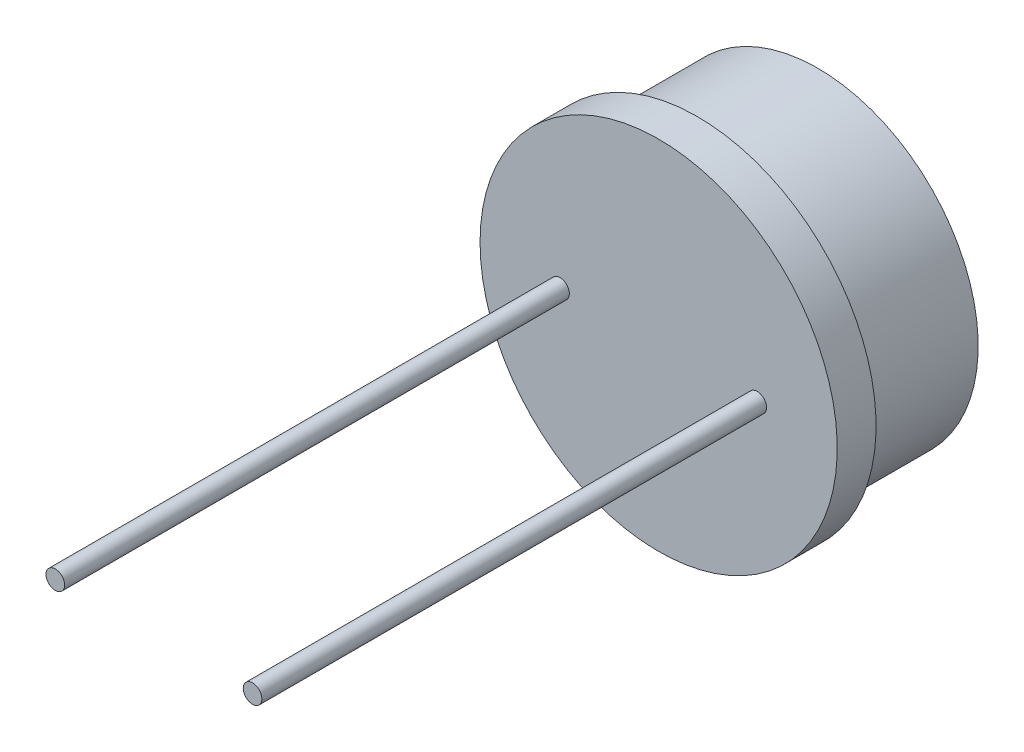
ISO-10303-21;
HEADER;
FILE_DESCRIPTION(('STEP AP214'),'2;1');
FILE_NAME('part.step','',(''),(''),'','','');
FILE_SCHEMA(('AUTOMOTIVE_DESIGN { 1 0 10303 214 1 1 1 1 }'));
ENDSEC;
DATA;
#1=APPLICATION_CONTEXT('core data for automotive mechanical design processes');
#2=APPLICATION_PROTOCOL_DEFINITION('international standard','automotive_design',2000,#1);
#3=PRODUCT_CONTEXT('',#1,'mechanical');
#4=PRODUCT('Part','Part','',(#3));
#5=PRODUCT_RELATED_PRODUCT_CATEGORY('part','',(#4));
#6=PRODUCT_DEFINITION_FORMATION('','',#4);
#7=PRODUCT_DEFINITION_CONTEXT('part definition',#1,'design');
#8=PRODUCT_DEFINITION('design','',#6,#7);
#9=PRODUCT_DEFINITION_SHAPE('','',#8);
#10=(LENGTH_UNIT() NAMED_UNIT(*) SI_UNIT(.MILLI.,.METRE.));
#11=(NAMED_UNIT(*) PLANE_ANGLE_UNIT() SI_UNIT($,.RADIAN.));
#12=(NAMED_UNIT(*) SI_UNIT($,.STERADIAN.) SOLID_ANGLE_UNIT());
#13=UNCERTAINTY_MEASURE_WITH_UNIT(LENGTH_MEASURE(1.E-05),#10,'distance_accuracy_value','');
#14=(GEOMETRIC_REPRESENTATION_CONTEXT(3) GLOBAL_UNCERTAINTY_ASSIGNED_CONTEXT((#13)) GLOBAL_UNIT_ASSIGNED_CONTEXT((#10,
#11,#12)) REPRESENTATION_CONTEXT('',''));
#15=CARTESIAN_POINT('',(0.,0.,0.));
#16=DIRECTION('',(0.,0.,1.));
#17=DIRECTION('',(1.,0.,0.));
#18=AXIS2_PLACEMENT_3D('',#15,#16,#17);
#19=CARTESIAN_POINT('',(0.,0.,0.));
#20=DIRECTION('',(0.,0.,-1.));
#21=DIRECTION('',(-1.,0.,0.));
#22=AXIS2_PLACEMENT_3D('',#19,#20,#21);
#23=PLANE('',#22);
#24=CARTESIAN_POINT('',(2.54,0.,0.));
#25=DIRECTION('',(0.,0.,-1.));
#26=DIRECTION('',(-1.,0.,0.));
#27=AXIS2_PLACEMENT_3D('',#24,#25,#26);
#28=CIRCLE('',#27,0.24);
#29=CARTESIAN_POINT('',(2.3,0.,0.));
#30=VERTEX_POINT('',#29);
#31=EDGE_CURVE('E10',#30,#30,#28,.F.);
#32=ORIENTED_EDGE('',*,*,#31,.F.);
#33=EDGE_LOOP('',(#32));
#34=FACE_BOUND('',#33,.T.);
#35=CARTESIAN_POINT('',(-2.54,0.,0.));
#36=DIRECTION('',(0.,0.,-1.));
#37=DIRECTION('',(-1.,0.,0.));
#38=AXIS2_PLACEMENT_3D('',#35,#36,#37);
#39=CIRCLE('',#38,0.24);
#40=CARTESIAN_POINT('',(-2.78,0.,0.));
#41=VERTEX_POINT('',#40);
#42=EDGE_CURVE('E43',#41,#41,#39,.F.);
#43=ORIENTED_EDGE('',*,*,#42,.F.);
#44=EDGE_LOOP('',(#43));
#45=FACE_BOUND('',#44,.T.);
#46=CARTESIAN_POINT('',(0.,0.,0.));
#47=DIRECTION('',(0.,0.,-1.));
#48=DIRECTION('',(-1.,0.,0.));
#49=AXIS2_PLACEMENT_3D('',#46,#47,#48);
#50=CIRCLE('',#49,4.6);
#51=CARTESIAN_POINT('',(-4.6,0.,0.));
#52=VERTEX_POINT('',#51);
#53=EDGE_CURVE('E47',#52,#52,#50,.T.);
#54=ORIENTED_EDGE('',*,*,#53,.F.);
#55=EDGE_LOOP('',(#54));
#56=FACE_BOUND('',#55,.T.);
#57=ADVANCED_FACE('F37',(#34,#45,#56),#23,.F.);
#58=CARTESIAN_POINT('',(0.,0.,-3.9));
#59=DIRECTION('',(0.,0.,-1.));
#60=DIRECTION('',(-1.,0.,0.));
#61=AXIS2_PLACEMENT_3D('',#58,#59,#60);
#62=CYLINDRICAL_SURFACE('',#61,4.6);
#63=CARTESIAN_POINT('',(0.,0.,-1.));
#64=DIRECTION('',(0.,0.,-1.));
#65=DIRECTION('',(-1.,0.,0.));
#66=AXIS2_PLACEMENT_3D('',#63,#64,#65);
#67=CIRCLE('',#66,4.6);
#68=CARTESIAN_POINT('',(-4.6,0.,-1.));
#69=VERTEX_POINT('',#68);
#70=EDGE_CURVE('E51',#69,#69,#67,.T.);
#71=ORIENTED_EDGE('',*,*,#70,.F.);
#72=EDGE_LOOP('',(#71));
#73=FACE_BOUND('',#72,.T.);
#74=ORIENTED_EDGE('',*,*,#53,.T.);
#75=EDGE_LOOP('',(#74));
#76=FACE_BOUND('',#75,.T.);
#77=ADVANCED_FACE('F90',(#73,#76),#62,.T.);
#78=CARTESIAN_POINT('',(4.6,0.,-1.));
#79=DIRECTION('',(0.,0.,1.));
#80=DIRECTION('',(1.,0.,0.));
#81=AXIS2_PLACEMENT_3D('',#78,#79,#80);
#82=PLANE('',#81);
#83=CARTESIAN_POINT('',(0.,0.,-1.));
#84=DIRECTION('',(0.,0.,-1.));
#85=DIRECTION('',(-1.,0.,0.));
#86=AXIS2_PLACEMENT_3D('',#83,#84,#85);
#87=CIRCLE('',#86,4.13);
#88=CARTESIAN_POINT('',(-4.13,0.,-1.));
#89=VERTEX_POINT('',#88);
#90=EDGE_CURVE('E56',#89,#89,#87,.T.);
#91=ORIENTED_EDGE('',*,*,#90,.F.);
#92=EDGE_LOOP('',(#91));
#93=FACE_BOUND('',#92,.T.);
#94=ORIENTED_EDGE('',*,*,#70,.T.);
#95=EDGE_LOOP('',(#94));
#96=FACE_BOUND('',#95,.T.);
#97=ADVANCED_FACE('F95',(#93,#96),#82,.F.);
#98=CARTESIAN_POINT('',(0.,0.,-3.9));
#99=DIRECTION('',(0.,0.,-1.));
#100=DIRECTION('',(-1.,0.,0.));
#101=AXIS2_PLACEMENT_3D('',#98,#99,#100);
#102=CYLINDRICAL_SURFACE('',#101,4.13);
#103=CARTESIAN_POINT('',(0.,0.,-4.1));
#104=DIRECTION('',(0.,0.,-1.));
#105=DIRECTION('',(-1.,0.,0.));
#106=AXIS2_PLACEMENT_3D('',#103,#104,#105);
#107=CIRCLE('',#106,4.13);
#108=CARTESIAN_POINT('',(-4.13,0.,-4.1));
#109=VERTEX_POINT('',#108);
#110=EDGE_CURVE('E59',#109,#109,#107,.T.);
#111=ORIENTED_EDGE('',*,*,#110,.F.);
#112=EDGE_LOOP('',(#111));
#113=FACE_BOUND('',#112,.T.);
#114=ORIENTED_EDGE('',*,*,#90,.T.);
#115=EDGE_LOOP('',(#114));
#116=FACE_BOUND('',#115,.T.);
#117=ADVANCED_FACE('F104',(#113,#116),#102,.T.);
#118=CARTESIAN_POINT('',(4.13,0.,-4.1));
#119=DIRECTION('',(0.,0.,1.));
#120=DIRECTION('',(1.,0.,0.));
#121=AXIS2_PLACEMENT_3D('',#118,#119,#120);
#122=PLANE('',#121);
#123=CARTESIAN_POINT('',(0.,0.,-4.1));
#124=DIRECTION('',(0.,0.,-1.));
#125=DIRECTION('',(-1.,0.,0.));
#126=AXIS2_PLACEMENT_3D('',#123,#124,#125);
#127=CIRCLE('',#126,3.63);
#128=CARTESIAN_POINT('',(-3.63,0.,-4.1));
#129=VERTEX_POINT('',#128);
#130=EDGE_CURVE('E62',#129,#129,#127,.T.);
#131=ORIENTED_EDGE('',*,*,#130,.F.);
#132=EDGE_LOOP('',(#131));
#133=FACE_BOUND('',#132,.T.);
#134=ORIENTED_EDGE('',*,*,#110,.T.);
#135=EDGE_LOOP('',(#134));
#136=FACE_BOUND('',#135,.T.);
#137=ADVANCED_FACE('F111',(#133,#136),#122,.F.);
#138=CARTESIAN_POINT('',(0.,0.,-3.9));
#139=DIRECTION('',(0.,0.,-1.));
#140=DIRECTION('',(-1.,0.,0.));
#141=AXIS2_PLACEMENT_3D('',#138,#139,#140);
#142=CYLINDRICAL_SURFACE('',#141,3.63);
#143=CARTESIAN_POINT('',(0.,0.,-3.9));
#144=DIRECTION('',(0.,0.,-1.));
#145=DIRECTION('',(-1.,0.,0.));
#146=AXIS2_PLACEMENT_3D('',#143,#144,#145);
#147=CIRCLE('',#146,3.63);
#148=CARTESIAN_POINT('',(-3.63,0.,-3.9));
#149=VERTEX_POINT('',#148);
#150=EDGE_CURVE('E65',#149,#149,#147,.T.);
#151=ORIENTED_EDGE('',*,*,#150,.F.);
#152=EDGE_LOOP('',(#151));
#153=FACE_BOUND('',#152,.T.);
#154=ORIENTED_EDGE('',*,*,#130,.T.);
#155=EDGE_LOOP('',(#154));
#156=FACE_BOUND('',#155,.T.);
#157=ADVANCED_FACE('F115',(#153,#156),#142,.F.);
#158=CARTESIAN_POINT('',(3.63,0.,-3.9));
#159=DIRECTION('',(0.,0.,1.));
#160=DIRECTION('',(1.,0.,0.));
#161=AXIS2_PLACEMENT_3D('',#158,#159,#160);
#162=PLANE('',#161);
#163=ORIENTED_EDGE('',*,*,#150,.T.);
#164=EDGE_LOOP('',(#163));
#165=FACE_BOUND('',#164,.T.);
#166=ADVANCED_FACE('F119',(#165),#162,.F.);
#167=CARTESIAN_POINT('',(-2.54,0.,13.));
#168=DIRECTION('',(0.,0.,-1.));
#169=DIRECTION('',(-1.,0.,0.));
#170=AXIS2_PLACEMENT_3D('',#167,#168,#169);
#171=CYLINDRICAL_SURFACE('',#170,0.24);
#172=CARTESIAN_POINT('',(-2.54,0.,13.));
#173=DIRECTION('',(0.,0.,1.));
#174=DIRECTION('',(1.,0.,0.));
#175=AXIS2_PLACEMENT_3D('',#172,#173,#174);
#176=CIRCLE('',#175,0.24);
#177=CARTESIAN_POINT('',(-2.3,0.,13.));
#178=VERTEX_POINT('',#177);
#179=EDGE_CURVE('E68',#178,#178,#176,.T.);
#180=ORIENTED_EDGE('',*,*,#179,.F.);
#181=EDGE_LOOP('',(#180));
#182=FACE_BOUND('',#181,.T.);
#183=ORIENTED_EDGE('',*,*,#42,.T.);
#184=EDGE_LOOP('',(#183));
#185=FACE_BOUND('',#184,.T.);
#186=ADVANCED_FACE('F86',(#182,#185),#171,.T.);
#187=CARTESIAN_POINT('',(-2.54,0.,13.));
#188=DIRECTION('',(0.,0.,1.));
#189=DIRECTION('',(1.,0.,0.));
#190=AXIS2_PLACEMENT_3D('',#187,#188,#189);
#191=PLANE('',#190);
#192=ORIENTED_EDGE('',*,*,#179,.T.);
#193=EDGE_LOOP('',(#192));
#194=FACE_BOUND('',#193,.T.);
#195=ADVANCED_FACE('F79',(#194),#191,.T.);
#196=CARTESIAN_POINT('',(2.54,0.,13.));
#197=DIRECTION('',(0.,0.,-1.));
#198=DIRECTION('',(-1.,0.,0.));
#199=AXIS2_PLACEMENT_3D('',#196,#197,#198);
#200=CYLINDRICAL_SURFACE('',#199,0.24);
#201=CARTESIAN_POINT('',(2.54,0.,13.));
#202=DIRECTION('',(0.,0.,1.));
#203=DIRECTION('',(1.,0.,0.));
#204=AXIS2_PLACEMENT_3D('',#201,#202,#203);
#205=CIRCLE('',#204,0.24);
#206=CARTESIAN_POINT('',(2.78,0.,13.));
#207=VERTEX_POINT('',#206);
#208=EDGE_CURVE('E71',#207,#207,#205,.T.);
#209=ORIENTED_EDGE('',*,*,#208,.F.);
#210=EDGE_LOOP('',(#209));
#211=FACE_BOUND('',#210,.T.);
#212=ORIENTED_EDGE('',*,*,#31,.T.);
#213=EDGE_LOOP('',(#212));
#214=FACE_BOUND('',#213,.T.);
#215=ADVANCED_FACE('F77',(#211,#214),#200,.T.);
#216=CARTESIAN_POINT('',(2.54,0.,13.));
#217=DIRECTION('',(0.,0.,1.));
#218=DIRECTION('',(1.,0.,0.));
#219=AXIS2_PLACEMENT_3D('',#216,#217,#218);
#220=PLANE('',#219);
#221=ORIENTED_EDGE('',*,*,#208,.T.);
#222=EDGE_LOOP('',(#221));
#223=FACE_BOUND('',#222,.T.);
#224=ADVANCED_FACE('F75',(#223),#220,.T.);
#225=CLOSED_SHELL('',(#57,#77,#97,#117,#137,#157,#166,#186,#195,#215,#224));
#226=MANIFOLD_SOLID_BREP('B2',#225);
#227=ADVANCED_BREP_SHAPE_REPRESENTATION('',(#18,#226),#14);
#228=SHAPE_DEFINITION_REPRESENTATION(#9,#227);
ENDSEC;
END-ISO-10303-21;
